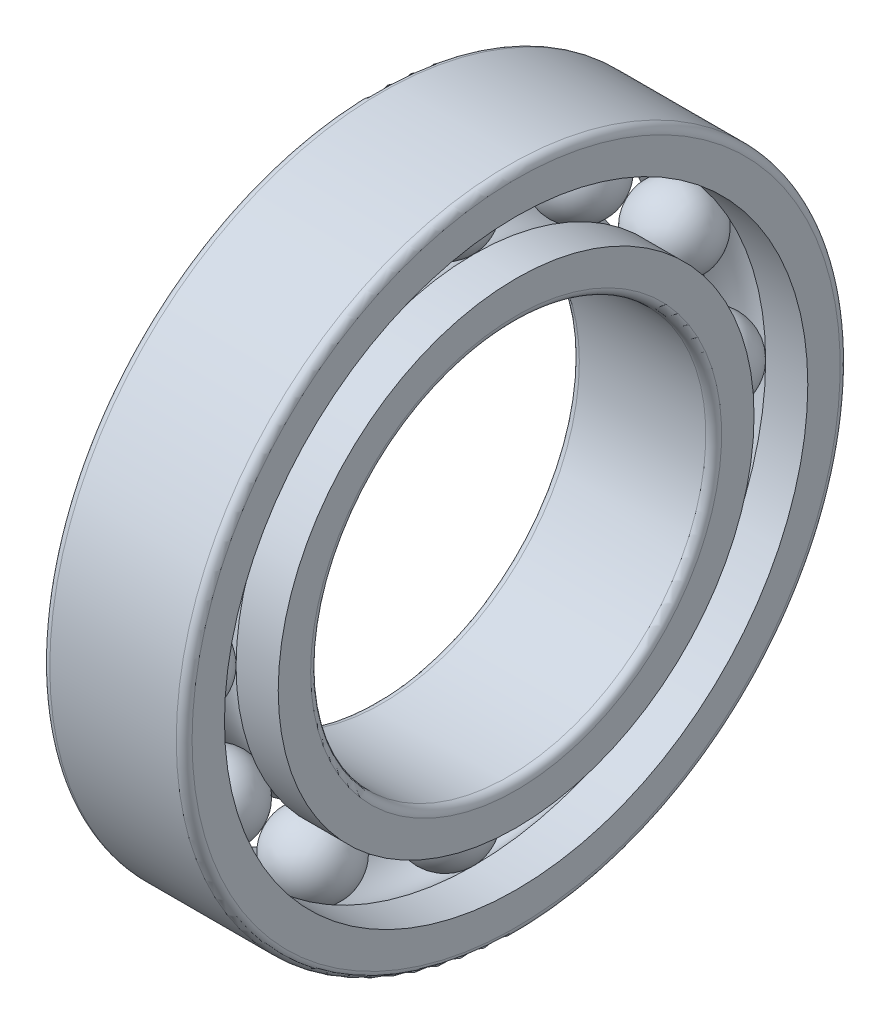
ISO-10303-21;
HEADER;
FILE_DESCRIPTION(('STEP AP214'),'2;1');
FILE_NAME('part.step','',(''),(''),'','','');
FILE_SCHEMA(('AUTOMOTIVE_DESIGN { 1 0 10303 214 1 1 1 1 }'));
ENDSEC;
DATA;
#1=APPLICATION_CONTEXT('core data for automotive mechanical design processes');
#2=APPLICATION_PROTOCOL_DEFINITION('international standard','automotive_design',2000,#1);
#3=PRODUCT_CONTEXT('',#1,'mechanical');
#4=PRODUCT('Part','Part','',(#3));
#5=PRODUCT_RELATED_PRODUCT_CATEGORY('part','',(#4));
#6=PRODUCT_DEFINITION_FORMATION('','',#4);
#7=PRODUCT_DEFINITION_CONTEXT('part definition',#1,'design');
#8=PRODUCT_DEFINITION('design','',#6,#7);
#9=PRODUCT_DEFINITION_SHAPE('','',#8);
#10=(LENGTH_UNIT() NAMED_UNIT(*) SI_UNIT(.MILLI.,.METRE.));
#11=(NAMED_UNIT(*) PLANE_ANGLE_UNIT() SI_UNIT($,.RADIAN.));
#12=(NAMED_UNIT(*) SI_UNIT($,.STERADIAN.) SOLID_ANGLE_UNIT());
#13=UNCERTAINTY_MEASURE_WITH_UNIT(LENGTH_MEASURE(1.E-05),#10,'distance_accuracy_value','');
#14=(GEOMETRIC_REPRESENTATION_CONTEXT(3) GLOBAL_UNCERTAINTY_ASSIGNED_CONTEXT((#13)) GLOBAL_UNIT_ASSIGNED_CONTEXT((#10,
#11,#12)) REPRESENTATION_CONTEXT('',''));
#15=CARTESIAN_POINT('',(0.,0.,0.));
#16=DIRECTION('',(0.,0.,1.));
#17=DIRECTION('',(1.,0.,0.));
#18=AXIS2_PLACEMENT_3D('',#15,#16,#17);
#19=CARTESIAN_POINT('',(4.50000000000001,14.5059255133895,-8.37499999999983));
#20=DIRECTION('',(-1.,0.,0.));
#21=DIRECTION('',(0.,0.866025403784445,-0.499999999999989));
#22=AXIS2_PLACEMENT_3D('',#19,#20,#21);
#23=SPHERICAL_SURFACE('',#22,2.49999999999999);
#24=CARTESIAN_POINT('',(2.00000000000002,14.5059255133895,-8.37499999999983));
#25=VERTEX_POINT('',#24);
#26=VERTEX_LOOP('',#25);
#27=FACE_BOUND('',#26,.T.);
#28=ADVANCED_FACE('F38',(#27),#23,.T.);
#29=CLOSED_SHELL('',(#28));
#30=MANIFOLD_SOLID_BREP('B2',#29);
#31=CARTESIAN_POINT('',(4.50000000000001,8.37500000000018,-14.5059255133893));
#32=DIRECTION('',(-1.,0.,0.));
#33=DIRECTION('',(0.,0.50000000000001,-0.866025403784433));
#34=AXIS2_PLACEMENT_3D('',#31,#32,#33);
#35=SPHERICAL_SURFACE('',#34,2.49999999999999);
#36=CARTESIAN_POINT('',(2.00000000000002,8.37500000000018,-14.5059255133893));
#37=VERTEX_POINT('',#36);
#38=VERTEX_LOOP('',#37);
#39=FACE_BOUND('',#38,.T.);
#40=ADVANCED_FACE('F57',(#39),#35,.T.);
#41=CLOSED_SHELL('',(#40));
#42=MANIFOLD_SOLID_BREP('B6',#41);
#43=CARTESIAN_POINT('',(4.50000000000001,1.75446937276868E-13,-16.75));
#44=DIRECTION('',(-1.,0.,0.));
#45=DIRECTION('',(0.,0.,-1.));
#46=AXIS2_PLACEMENT_3D('',#43,#44,#45);
#47=SPHERICAL_SURFACE('',#46,2.49999999999999);
#48=CARTESIAN_POINT('',(2.00000000000002,1.75446937276868E-13,-16.75));
#49=VERTEX_POINT('',#48);
#50=VERTEX_LOOP('',#49);
#51=FACE_BOUND('',#50,.T.);
#52=ADVANCED_FACE('F76',(#51),#47,.T.);
#53=CLOSED_SHELL('',(#52));
#54=MANIFOLD_SOLID_BREP('B34',#53);
#55=CARTESIAN_POINT('',(4.50000000000001,-8.37499999999988,-14.5059255133894));
#56=DIRECTION('',(-1.,0.,0.));
#57=DIRECTION('',(0.,-0.499999999999992,-0.866025403784443));
#58=AXIS2_PLACEMENT_3D('',#55,#56,#57);
#59=SPHERICAL_SURFACE('',#58,2.49999999999999);
#60=CARTESIAN_POINT('',(2.00000000000002,-8.37499999999988,-14.5059255133894));
#61=VERTEX_POINT('',#60);
#62=VERTEX_LOOP('',#61);
#63=FACE_BOUND('',#62,.T.);
#64=ADVANCED_FACE('F95',(#63),#59,.T.);
#65=CLOSED_SHELL('',(#64));
#66=MANIFOLD_SOLID_BREP('B53',#65);
#67=CARTESIAN_POINT('',(4.50000000000001,-14.5059255133893,-8.37500000000013));
#68=DIRECTION('',(-1.,0.,0.));
#69=DIRECTION('',(0.,-0.866025403784435,-0.500000000000007));
#70=AXIS2_PLACEMENT_3D('',#67,#68,#69);
#71=SPHERICAL_SURFACE('',#70,2.49999999999999);
#72=CARTESIAN_POINT('',(2.00000000000002,-14.5059255133893,-8.37500000000013));
#73=VERTEX_POINT('',#72);
#74=VERTEX_LOOP('',#73);
#75=FACE_BOUND('',#74,.T.);
#76=ADVANCED_FACE('F114',(#75),#71,.T.);
#77=CLOSED_SHELL('',(#76));
#78=MANIFOLD_SOLID_BREP('B72',#77);
#79=CARTESIAN_POINT('',(4.50000000000001,-16.75,0.));
#80=DIRECTION('',(-1.,0.,0.));
#81=DIRECTION('',(0.,-1.,0.));
#82=AXIS2_PLACEMENT_3D('',#79,#80,#81);
#83=SPHERICAL_SURFACE('',#82,2.49999999999999);
#84=CARTESIAN_POINT('',(2.00000000000002,-16.75,0.));
#85=VERTEX_POINT('',#84);
#86=VERTEX_LOOP('',#85);
#87=FACE_BOUND('',#86,.T.);
#88=ADVANCED_FACE('F133',(#87),#83,.T.);
#89=CLOSED_SHELL('',(#88));
#90=MANIFOLD_SOLID_BREP('B91',#89);
#91=CARTESIAN_POINT('',(4.50000000000001,-14.5059255133894,8.37499999999993));
#92=DIRECTION('',(-1.,0.,0.));
#93=DIRECTION('',(0.,-0.866025403784442,0.499999999999995));
#94=AXIS2_PLACEMENT_3D('',#91,#92,#93);
#95=SPHERICAL_SURFACE('',#94,2.49999999999999);
#96=CARTESIAN_POINT('',(2.00000000000002,-14.5059255133894,8.37499999999993));
#97=VERTEX_POINT('',#96);
#98=VERTEX_LOOP('',#97);
#99=FACE_BOUND('',#98,.T.);
#100=ADVANCED_FACE('F152',(#99),#95,.T.);
#101=CLOSED_SHELL('',(#100));
#102=MANIFOLD_SOLID_BREP('B110',#101);
#103=CARTESIAN_POINT('',(4.50000000000001,-8.37500000000008,14.5059255133893));
#104=DIRECTION('',(-1.,0.,0.));
#105=DIRECTION('',(0.,-0.500000000000004,0.866025403784436));
#106=AXIS2_PLACEMENT_3D('',#103,#104,#105);
#107=SPHERICAL_SURFACE('',#106,2.49999999999999);
#108=CARTESIAN_POINT('',(2.00000000000002,-8.37500000000008,14.5059255133893));
#109=VERTEX_POINT('',#108);
#110=VERTEX_LOOP('',#109);
#111=FACE_BOUND('',#110,.T.);
#112=ADVANCED_FACE('F171',(#111),#107,.T.);
#113=CLOSED_SHELL('',(#112));
#114=MANIFOLD_SOLID_BREP('B129',#113);
#115=CARTESIAN_POINT('',(4.50000000000001,0.,16.75));
#116=DIRECTION('',(-1.,0.,0.));
#117=DIRECTION('',(0.,0.,1.));
#118=AXIS2_PLACEMENT_3D('',#115,#116,#117);
#119=SPHERICAL_SURFACE('',#118,2.49999999999999);
#120=CARTESIAN_POINT('',(2.00000000000002,0.,16.75));
#121=VERTEX_POINT('',#120);
#122=VERTEX_LOOP('',#121);
#123=FACE_BOUND('',#122,.T.);
#124=ADVANCED_FACE('F190',(#123),#119,.T.);
#125=CLOSED_SHELL('',(#124));
#126=MANIFOLD_SOLID_BREP('B148',#125);
#127=CARTESIAN_POINT('',(4.50000000000001,8.37499999999998,14.5059255133894));
#128=DIRECTION('',(-1.,0.,0.));
#129=DIRECTION('',(0.,0.499999999999998,0.86602540378444));
#130=AXIS2_PLACEMENT_3D('',#127,#128,#129);
#131=SPHERICAL_SURFACE('',#130,2.49999999999999);
#132=CARTESIAN_POINT('',(2.00000000000002,8.37499999999998,14.5059255133894));
#133=VERTEX_POINT('',#132);
#134=VERTEX_LOOP('',#133);
#135=FACE_BOUND('',#134,.T.);
#136=ADVANCED_FACE('F209',(#135),#131,.T.);
#137=CLOSED_SHELL('',(#136));
#138=MANIFOLD_SOLID_BREP('B167',#137);
#139=CARTESIAN_POINT('',(4.50000000000001,14.5059255133894,8.37500000000003));
#140=DIRECTION('',(-1.,0.,0.));
#141=DIRECTION('',(0.,0.866025403784438,0.500000000000001));
#142=AXIS2_PLACEMENT_3D('',#139,#140,#141);
#143=SPHERICAL_SURFACE('',#142,2.49999999999999);
#144=CARTESIAN_POINT('',(2.00000000000002,14.5059255133894,8.37500000000003));
#145=VERTEX_POINT('',#144);
#146=VERTEX_LOOP('',#145);
#147=FACE_BOUND('',#146,.T.);
#148=ADVANCED_FACE('F228',(#147),#143,.T.);
#149=CLOSED_SHELL('',(#148));
#150=MANIFOLD_SOLID_BREP('B186',#149);
#151=CARTESIAN_POINT('',(4.50000000000001,16.75,0.));
#152=DIRECTION('',(-1.,0.,0.));
#153=DIRECTION('',(0.,1.,0.));
#154=AXIS2_PLACEMENT_3D('',#151,#152,#153);
#155=SPHERICAL_SURFACE('',#154,2.49999999999999);
#156=CARTESIAN_POINT('',(2.00000000000002,16.75,0.));
#157=VERTEX_POINT('',#156);
#158=VERTEX_LOOP('',#157);
#159=FACE_BOUND('',#158,.T.);
#160=ADVANCED_FACE('F249',(#159),#155,.T.);
#161=CLOSED_SHELL('',(#160));
#162=MANIFOLD_SOLID_BREP('B205',#161);
#163=CARTESIAN_POINT('',(0.,0.,0.));
#164=DIRECTION('',(-1.,0.,0.));
#165=DIRECTION('',(0.,0.,1.));
#166=AXIS2_PLACEMENT_3D('',#163,#164,#165);
#167=CYLINDRICAL_SURFACE('',#166,18.45);
#168=CARTESIAN_POINT('',(2.66696972201768,0.,0.));
#169=DIRECTION('',(-1.,0.,0.));
#170=DIRECTION('',(0.,0.,1.));
#171=AXIS2_PLACEMENT_3D('',#168,#169,#170);
#172=CIRCLE('',#171,18.45);
#173=CARTESIAN_POINT('',(2.66696972201768,0.,18.45));
#174=VERTEX_POINT('',#173);
#175=EDGE_CURVE('E298',#174,#174,#172,.T.);
#176=ORIENTED_EDGE('',*,*,#175,.F.);
#177=EDGE_LOOP('',(#176));
#178=FACE_BOUND('',#177,.T.);
#179=CARTESIAN_POINT('',(0.,0.,0.));
#180=DIRECTION('',(-1.,0.,0.));
#181=DIRECTION('',(0.,0.,1.));
#182=AXIS2_PLACEMENT_3D('',#179,#180,#181);
#183=CIRCLE('',#182,18.45);
#184=CARTESIAN_POINT('',(0.,0.,18.45));
#185=VERTEX_POINT('',#184);
#186=EDGE_CURVE('E289',#185,#185,#183,.T.);
#187=ORIENTED_EDGE('',*,*,#186,.T.);
#188=EDGE_LOOP('',(#187));
#189=FACE_BOUND('',#188,.T.);
#190=ADVANCED_FACE('F269',(#178,#189),#167,.F.);
#191=CARTESIAN_POINT('',(0.,21.0000000000008,0.));
#192=DIRECTION('',(1.,0.,0.));
#193=DIRECTION('',(0.,0.,-1.));
#194=AXIS2_PLACEMENT_3D('',#191,#192,#193);
#195=PLANE('',#194);
#196=CARTESIAN_POINT('',(0.,0.,0.));
#197=DIRECTION('',(1.,0.,0.));
#198=DIRECTION('',(0.,0.,-1.));
#199=AXIS2_PLACEMENT_3D('',#196,#197,#198);
#200=CIRCLE('',#199,20.5000000000004);
#201=CARTESIAN_POINT('',(0.,0.,-20.5000000000004));
#202=VERTEX_POINT('',#201);
#203=EDGE_CURVE('E248',#202,#202,#200,.F.);
#204=ORIENTED_EDGE('',*,*,#203,.T.);
#205=EDGE_LOOP('',(#204));
#206=FACE_BOUND('',#205,.T.);
#207=ORIENTED_EDGE('',*,*,#186,.F.);
#208=EDGE_LOOP('',(#207));
#209=FACE_BOUND('',#208,.T.);
#210=ADVANCED_FACE('F307',(#206,#209),#195,.F.);
#211=CARTESIAN_POINT('',(0.,0.,0.));
#212=DIRECTION('',(-1.,0.,0.));
#213=DIRECTION('',(0.,0.,1.));
#214=AXIS2_PLACEMENT_3D('',#211,#212,#213);
#215=CYLINDRICAL_SURFACE('',#214,21.0000000000004);
#216=CARTESIAN_POINT('',(8.5,0.,0.));
#217=DIRECTION('',(-1.,0.,0.));
#218=DIRECTION('',(0.,0.,1.));
#219=AXIS2_PLACEMENT_3D('',#216,#217,#218);
#220=CIRCLE('',#219,21.0000000000004);
#221=CARTESIAN_POINT('',(8.5,0.,21.0000000000004));
#222=VERTEX_POINT('',#221);
#223=EDGE_CURVE('E280',#222,#222,#220,.T.);
#224=ORIENTED_EDGE('',*,*,#223,.T.);
#225=EDGE_LOOP('',(#224));
#226=FACE_BOUND('',#225,.T.);
#227=CARTESIAN_POINT('',(0.5,0.,0.));
#228=DIRECTION('',(1.,0.,0.));
#229=DIRECTION('',(0.,0.,-1.));
#230=AXIS2_PLACEMENT_3D('',#227,#228,#229);
#231=CIRCLE('',#230,21.0000000000004);
#232=CARTESIAN_POINT('',(0.5,0.,-21.0000000000004));
#233=VERTEX_POINT('',#232);
#234=EDGE_CURVE('E284',#233,#233,#231,.T.);
#235=ORIENTED_EDGE('',*,*,#234,.T.);
#236=EDGE_LOOP('',(#235));
#237=FACE_BOUND('',#236,.T.);
#238=ADVANCED_FACE('F312',(#226,#237),#215,.T.);
#239=CARTESIAN_POINT('',(9.,18.45,0.));
#240=DIRECTION('',(-1.,0.,0.));
#241=DIRECTION('',(0.,0.,1.));
#242=AXIS2_PLACEMENT_3D('',#239,#240,#241);
#243=PLANE('',#242);
#244=CARTESIAN_POINT('',(9.,0.,0.));
#245=DIRECTION('',(-1.,0.,0.));
#246=DIRECTION('',(0.,0.,1.));
#247=AXIS2_PLACEMENT_3D('',#244,#245,#246);
#248=CIRCLE('',#247,20.5000000000004);
#249=CARTESIAN_POINT('',(9.,0.,20.5000000000004));
#250=VERTEX_POINT('',#249);
#251=EDGE_CURVE('E276',#250,#250,#248,.F.);
#252=ORIENTED_EDGE('',*,*,#251,.T.);
#253=EDGE_LOOP('',(#252));
#254=FACE_BOUND('',#253,.T.);
#255=CARTESIAN_POINT('',(9.,0.,0.));
#256=DIRECTION('',(-1.,0.,0.));
#257=DIRECTION('',(0.,0.,1.));
#258=AXIS2_PLACEMENT_3D('',#255,#256,#257);
#259=CIRCLE('',#258,18.45);
#260=CARTESIAN_POINT('',(9.,0.,18.45));
#261=VERTEX_POINT('',#260);
#262=EDGE_CURVE('E292',#261,#261,#259,.T.);
#263=ORIENTED_EDGE('',*,*,#262,.T.);
#264=EDGE_LOOP('',(#263));
#265=FACE_BOUND('',#264,.T.);
#266=ADVANCED_FACE('F317',(#254,#265),#243,.F.);
#267=CARTESIAN_POINT('',(0.,0.,0.));
#268=DIRECTION('',(-1.,0.,0.));
#269=DIRECTION('',(0.,0.,1.));
#270=AXIS2_PLACEMENT_3D('',#267,#268,#269);
#271=CYLINDRICAL_SURFACE('',#270,18.45);
#272=ORIENTED_EDGE('',*,*,#262,.F.);
#273=EDGE_LOOP('',(#272));
#274=FACE_BOUND('',#273,.T.);
#275=CARTESIAN_POINT('',(6.33303027798233,0.,0.));
#276=DIRECTION('',(-1.,0.,0.));
#277=DIRECTION('',(0.,0.,1.));
#278=AXIS2_PLACEMENT_3D('',#275,#276,#277);
#279=CIRCLE('',#278,18.45);
#280=CARTESIAN_POINT('',(6.33303027798233,0.,18.45));
#281=VERTEX_POINT('',#280);
#282=EDGE_CURVE('E295',#281,#281,#279,.T.);
#283=ORIENTED_EDGE('',*,*,#282,.T.);
#284=EDGE_LOOP('',(#283));
#285=FACE_BOUND('',#284,.T.);
#286=ADVANCED_FACE('F329',(#274,#285),#271,.F.);
#287=CARTESIAN_POINT('',(4.5,0.,0.));
#288=DIRECTION('',(-1.,0.,0.));
#289=DIRECTION('',(0.,0.,1.));
#290=AXIS2_PLACEMENT_3D('',#287,#288,#289);
#291=TOROIDAL_SURFACE('',#290,16.75,2.50000000000002);
#292=ORIENTED_EDGE('',*,*,#175,.T.);
#293=EDGE_LOOP('',(#292));
#294=FACE_BOUND('',#293,.T.);
#295=ORIENTED_EDGE('',*,*,#282,.F.);
#296=EDGE_LOOP('',(#295));
#297=FACE_BOUND('',#296,.T.);
#298=ADVANCED_FACE('F302',(#294,#297),#291,.F.);
#299=CARTESIAN_POINT('',(8.5,0.,0.));
#300=DIRECTION('',(-1.,0.,0.));
#301=DIRECTION('',(0.,0.,1.));
#302=AXIS2_PLACEMENT_3D('',#299,#300,#301);
#303=TOROIDAL_SURFACE('',#302,20.5000000000004,0.5);
#304=ORIENTED_EDGE('',*,*,#251,.F.);
#305=EDGE_LOOP('',(#304));
#306=FACE_BOUND('',#305,.T.);
#307=ORIENTED_EDGE('',*,*,#223,.F.);
#308=EDGE_LOOP('',(#307));
#309=FACE_BOUND('',#308,.T.);
#310=ADVANCED_FACE('F321',(#306,#309),#303,.T.);
#311=CARTESIAN_POINT('',(0.5,0.,0.));
#312=DIRECTION('',(1.,0.,0.));
#313=DIRECTION('',(0.,0.,-1.));
#314=AXIS2_PLACEMENT_3D('',#311,#312,#313);
#315=TOROIDAL_SURFACE('',#314,20.5000000000004,0.5);
#316=ORIENTED_EDGE('',*,*,#234,.F.);
#317=EDGE_LOOP('',(#316));
#318=FACE_BOUND('',#317,.T.);
#319=ORIENTED_EDGE('',*,*,#203,.F.);
#320=EDGE_LOOP('',(#319));
#321=FACE_BOUND('',#320,.T.);
#322=ADVANCED_FACE('F271',(#318,#321),#315,.T.);
#323=CLOSED_SHELL('',(#190,#210,#238,#266,#286,#298,#310,#322));
#324=MANIFOLD_SOLID_BREP('B224',#323);
#325=CARTESIAN_POINT('',(0.,0.,0.));
#326=DIRECTION('',(-1.,0.,0.));
#327=DIRECTION('',(0.,0.,1.));
#328=AXIS2_PLACEMENT_3D('',#325,#326,#327);
#329=CYLINDRICAL_SURFACE('',#328,15.05);
#330=CARTESIAN_POINT('',(0.,0.,0.));
#331=DIRECTION('',(-1.,0.,0.));
#332=DIRECTION('',(0.,0.,1.));
#333=AXIS2_PLACEMENT_3D('',#330,#331,#332);
#334=CIRCLE('',#333,15.05);
#335=CARTESIAN_POINT('',(0.,0.,15.05));
#336=VERTEX_POINT('',#335);
#337=EDGE_CURVE('E405',#336,#336,#334,.T.);
#338=ORIENTED_EDGE('',*,*,#337,.F.);
#339=EDGE_LOOP('',(#338));
#340=FACE_BOUND('',#339,.T.);
#341=CARTESIAN_POINT('',(2.66696972201767,0.,0.));
#342=DIRECTION('',(-1.,0.,0.));
#343=DIRECTION('',(0.,0.,1.));
#344=AXIS2_PLACEMENT_3D('',#341,#342,#343);
#345=CIRCLE('',#344,15.0500000000001);
#346=CARTESIAN_POINT('',(2.66696972201767,0.,15.0500000000001));
#347=VERTEX_POINT('',#346);
#348=EDGE_CURVE('E414',#347,#347,#345,.T.);
#349=ORIENTED_EDGE('',*,*,#348,.T.);
#350=EDGE_LOOP('',(#349));
#351=FACE_BOUND('',#350,.T.);
#352=ADVANCED_FACE('F385',(#340,#351),#329,.T.);
#353=CARTESIAN_POINT('',(0.,15.05,0.));
#354=DIRECTION('',(1.,0.,0.));
#355=DIRECTION('',(0.,0.,-1.));
#356=AXIS2_PLACEMENT_3D('',#353,#354,#355);
#357=PLANE('',#356);
#358=CARTESIAN_POINT('',(0.,0.,0.));
#359=DIRECTION('',(1.,0.,0.));
#360=DIRECTION('',(0.,0.,-1.));
#361=AXIS2_PLACEMENT_3D('',#358,#359,#360);
#362=CIRCLE('',#361,13.);
#363=CARTESIAN_POINT('',(0.,0.,-13.));
#364=VERTEX_POINT('',#363);
#365=EDGE_CURVE('E268',#364,#364,#362,.T.);
#366=ORIENTED_EDGE('',*,*,#365,.T.);
#367=EDGE_LOOP('',(#366));
#368=FACE_BOUND('',#367,.T.);
#369=ORIENTED_EDGE('',*,*,#337,.T.);
#370=EDGE_LOOP('',(#369));
#371=FACE_BOUND('',#370,.T.);
#372=ADVANCED_FACE('F434',(#368,#371),#357,.F.);
#373=CARTESIAN_POINT('',(0.,0.,0.));
#374=DIRECTION('',(-1.,0.,0.));
#375=DIRECTION('',(0.,0.,1.));
#376=AXIS2_PLACEMENT_3D('',#373,#374,#375);
#377=CYLINDRICAL_SURFACE('',#376,12.5);
#378=CARTESIAN_POINT('',(8.5,0.,0.));
#379=DIRECTION('',(-1.,0.,0.));
#380=DIRECTION('',(0.,0.,1.));
#381=AXIS2_PLACEMENT_3D('',#378,#379,#380);
#382=CIRCLE('',#381,12.5);
#383=CARTESIAN_POINT('',(8.5,0.,12.5));
#384=VERTEX_POINT('',#383);
#385=EDGE_CURVE('E392',#384,#384,#382,.F.);
#386=ORIENTED_EDGE('',*,*,#385,.T.);
#387=EDGE_LOOP('',(#386));
#388=FACE_BOUND('',#387,.T.);
#389=CARTESIAN_POINT('',(0.5,0.,0.));
#390=DIRECTION('',(1.,0.,0.));
#391=DIRECTION('',(0.,0.,-1.));
#392=AXIS2_PLACEMENT_3D('',#389,#390,#391);
#393=CIRCLE('',#392,12.5);
#394=CARTESIAN_POINT('',(0.5,0.,-12.5));
#395=VERTEX_POINT('',#394);
#396=EDGE_CURVE('E396',#395,#395,#393,.F.);
#397=ORIENTED_EDGE('',*,*,#396,.T.);
#398=EDGE_LOOP('',(#397));
#399=FACE_BOUND('',#398,.T.);
#400=ADVANCED_FACE('F440',(#388,#399),#377,.F.);
#401=CARTESIAN_POINT('',(9.,12.5000000000001,0.));
#402=DIRECTION('',(-1.,0.,0.));
#403=DIRECTION('',(0.,0.,1.));
#404=AXIS2_PLACEMENT_3D('',#401,#402,#403);
#405=PLANE('',#404);
#406=CARTESIAN_POINT('',(9.,0.,0.));
#407=DIRECTION('',(-1.,0.,0.));
#408=DIRECTION('',(0.,0.,1.));
#409=AXIS2_PLACEMENT_3D('',#406,#407,#408);
#410=CIRCLE('',#409,13.);
#411=CARTESIAN_POINT('',(9.,0.,13.));
#412=VERTEX_POINT('',#411);
#413=EDGE_CURVE('E400',#412,#412,#410,.T.);
#414=ORIENTED_EDGE('',*,*,#413,.T.);
#415=EDGE_LOOP('',(#414));
#416=FACE_BOUND('',#415,.T.);
#417=CARTESIAN_POINT('',(9.,0.,0.));
#418=DIRECTION('',(-1.,0.,0.));
#419=DIRECTION('',(0.,0.,1.));
#420=AXIS2_PLACEMENT_3D('',#417,#418,#419);
#421=CIRCLE('',#420,15.0500000000001);
#422=CARTESIAN_POINT('',(9.,0.,15.0500000000001));
#423=VERTEX_POINT('',#422);
#424=EDGE_CURVE('E408',#423,#423,#421,.T.);
#425=ORIENTED_EDGE('',*,*,#424,.F.);
#426=EDGE_LOOP('',(#425));
#427=FACE_BOUND('',#426,.T.);
#428=ADVANCED_FACE('F430',(#416,#427),#405,.F.);
#429=CARTESIAN_POINT('',(0.,0.,0.));
#430=DIRECTION('',(-1.,0.,0.));
#431=DIRECTION('',(0.,0.,1.));
#432=AXIS2_PLACEMENT_3D('',#429,#430,#431);
#433=CYLINDRICAL_SURFACE('',#432,15.0500000000001);
#434=CARTESIAN_POINT('',(6.33303027798233,0.,0.));
#435=DIRECTION('',(-1.,0.,0.));
#436=DIRECTION('',(0.,0.,1.));
#437=AXIS2_PLACEMENT_3D('',#434,#435,#436);
#438=CIRCLE('',#437,15.0500000000001);
#439=CARTESIAN_POINT('',(6.33303027798233,0.,15.0500000000001));
#440=VERTEX_POINT('',#439);
#441=EDGE_CURVE('E411',#440,#440,#438,.T.);
#442=ORIENTED_EDGE('',*,*,#441,.F.);
#443=EDGE_LOOP('',(#442));
#444=FACE_BOUND('',#443,.T.);
#445=ORIENTED_EDGE('',*,*,#424,.T.);
#446=EDGE_LOOP('',(#445));
#447=FACE_BOUND('',#446,.T.);
#448=ADVANCED_FACE('F422',(#444,#447),#433,.T.);
#449=CARTESIAN_POINT('',(4.5,0.,0.));
#450=DIRECTION('',(-1.,0.,0.));
#451=DIRECTION('',(0.,0.,1.));
#452=AXIS2_PLACEMENT_3D('',#449,#450,#451);
#453=TOROIDAL_SURFACE('',#452,16.75,2.49999999999996);
#454=ORIENTED_EDGE('',*,*,#441,.T.);
#455=EDGE_LOOP('',(#454));
#456=FACE_BOUND('',#455,.T.);
#457=ORIENTED_EDGE('',*,*,#348,.F.);
#458=EDGE_LOOP('',(#457));
#459=FACE_BOUND('',#458,.T.);
#460=ADVANCED_FACE('F419',(#456,#459),#453,.F.);
#461=CARTESIAN_POINT('',(8.5,0.,0.));
#462=DIRECTION('',(-1.,0.,0.));
#463=DIRECTION('',(0.,0.,1.));
#464=AXIS2_PLACEMENT_3D('',#461,#462,#463);
#465=TOROIDAL_SURFACE('',#464,13.,0.5);
#466=ORIENTED_EDGE('',*,*,#385,.F.);
#467=EDGE_LOOP('',(#466));
#468=FACE_BOUND('',#467,.T.);
#469=ORIENTED_EDGE('',*,*,#413,.F.);
#470=EDGE_LOOP('',(#469));
#471=FACE_BOUND('',#470,.T.);
#472=ADVANCED_FACE('F421',(#468,#471),#465,.T.);
#473=CARTESIAN_POINT('',(0.5,0.,0.));
#474=DIRECTION('',(1.,0.,0.));
#475=DIRECTION('',(0.,0.,-1.));
#476=AXIS2_PLACEMENT_3D('',#473,#474,#475);
#477=TOROIDAL_SURFACE('',#476,13.,0.5);
#478=ORIENTED_EDGE('',*,*,#365,.F.);
#479=EDGE_LOOP('',(#478));
#480=FACE_BOUND('',#479,.T.);
#481=ORIENTED_EDGE('',*,*,#396,.F.);
#482=EDGE_LOOP('',(#481));
#483=FACE_BOUND('',#482,.T.);
#484=ADVANCED_FACE('F387',(#480,#483),#477,.T.);
#485=CLOSED_SHELL('',(#352,#372,#400,#428,#448,#460,#472,#484));
#486=MANIFOLD_SOLID_BREP('B243',#485);
#487=ADVANCED_BREP_SHAPE_REPRESENTATION('',(#18,#30,#42,#54,#66,#78,#90,#102,#114,#126,#138,
#150,#162,#324,#486),#14);
#488=SHAPE_DEFINITION_REPRESENTATION(#9,#487);
ENDSEC;
END-ISO-10303-21;
